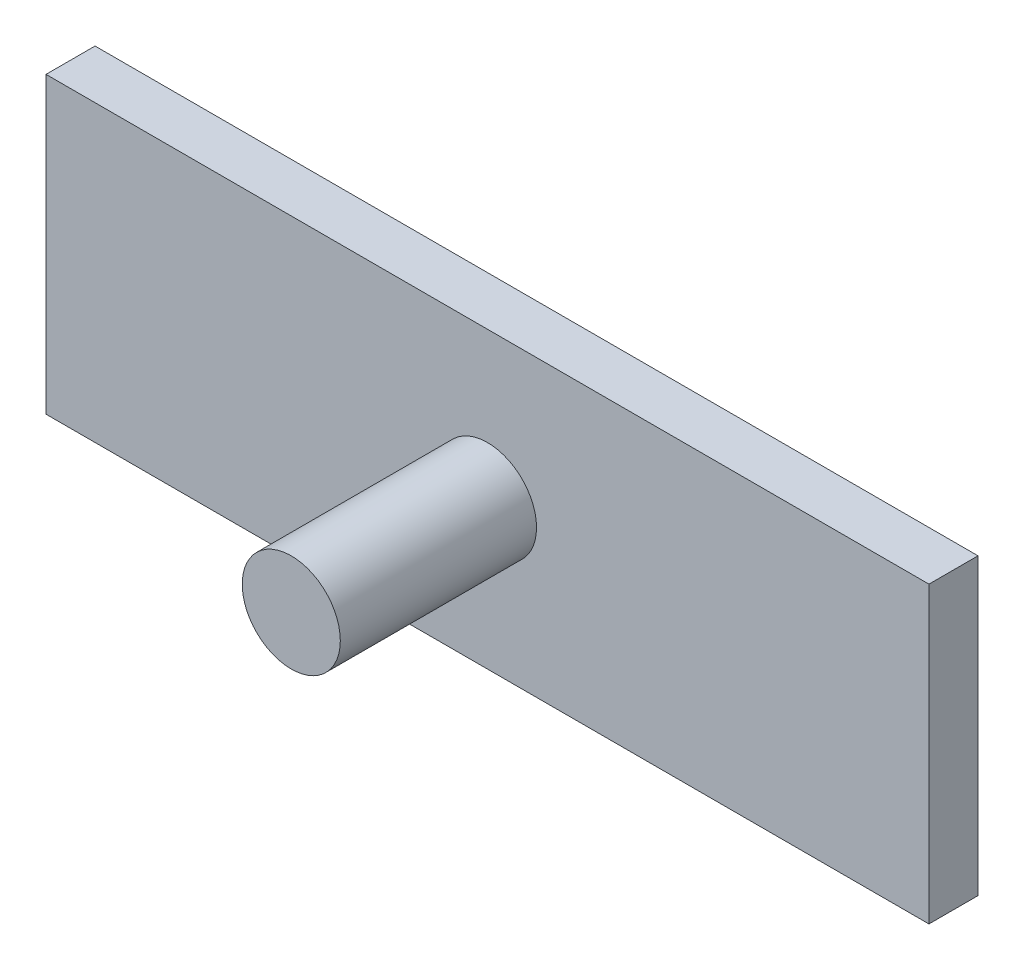
ISO-10303-21;
HEADER;
FILE_DESCRIPTION(('STEP AP214'),'2;1');
FILE_NAME('part.step','',(''),(''),'','','');
FILE_SCHEMA(('AUTOMOTIVE_DESIGN { 1 0 10303 214 1 1 1 1 }'));
ENDSEC;
DATA;
#1=APPLICATION_CONTEXT('core data for automotive mechanical design processes');
#2=APPLICATION_PROTOCOL_DEFINITION('international standard','automotive_design',2000,#1);
#3=PRODUCT_CONTEXT('',#1,'mechanical');
#4=PRODUCT('Part','Part','',(#3));
#5=PRODUCT_RELATED_PRODUCT_CATEGORY('part','',(#4));
#6=PRODUCT_DEFINITION_FORMATION('','',#4);
#7=PRODUCT_DEFINITION_CONTEXT('part definition',#1,'design');
#8=PRODUCT_DEFINITION('design','',#6,#7);
#9=PRODUCT_DEFINITION_SHAPE('','',#8);
#10=(LENGTH_UNIT() NAMED_UNIT(*) SI_UNIT(.MILLI.,.METRE.));
#11=(NAMED_UNIT(*) PLANE_ANGLE_UNIT() SI_UNIT($,.RADIAN.));
#12=(NAMED_UNIT(*) SI_UNIT($,.STERADIAN.) SOLID_ANGLE_UNIT());
#13=UNCERTAINTY_MEASURE_WITH_UNIT(LENGTH_MEASURE(1.E-05),#10,'distance_accuracy_value','');
#14=(GEOMETRIC_REPRESENTATION_CONTEXT(3) GLOBAL_UNCERTAINTY_ASSIGNED_CONTEXT((#13)) GLOBAL_UNIT_ASSIGNED_CONTEXT((#10,
#11,#12)) REPRESENTATION_CONTEXT('',''));
#15=CARTESIAN_POINT('',(0.,0.,0.));
#16=DIRECTION('',(0.,0.,1.));
#17=DIRECTION('',(1.,0.,0.));
#18=AXIS2_PLACEMENT_3D('',#15,#16,#17);
#19=CARTESIAN_POINT('',(0.,0.,5.));
#20=DIRECTION('',(0.,0.,1.));
#21=DIRECTION('',(1.,0.,0.));
#22=AXIS2_PLACEMENT_3D('',#19,#20,#21);
#23=PLANE('',#22);
#24=DIRECTION('',(0.,1.,0.));
#25=VECTOR('',#24,1.);
#26=CARTESIAN_POINT('',(0.,0.,5.));
#27=LINE('',#26,#25);
#28=CARTESIAN_POINT('',(0.,0.,5.));
#29=VERTEX_POINT('',#28);
#30=CARTESIAN_POINT('',(0.,30.,5.));
#31=VERTEX_POINT('',#30);
#32=EDGE_CURVE('E85',#29,#31,#27,.T.);
#33=ORIENTED_EDGE('',*,*,#32,.T.);
#34=DIRECTION('',(-1.,0.,0.));
#35=VECTOR('',#34,1.);
#36=CARTESIAN_POINT('',(0.,30.,5.));
#37=LINE('',#36,#35);
#38=CARTESIAN_POINT('',(-90.,30.,5.));
#39=VERTEX_POINT('',#38);
#40=EDGE_CURVE('E80',#31,#39,#37,.T.);
#41=ORIENTED_EDGE('',*,*,#40,.T.);
#42=DIRECTION('',(0.,-1.,0.));
#43=VECTOR('',#42,1.);
#44=CARTESIAN_POINT('',(-90.,0.,5.));
#45=LINE('',#44,#43);
#46=CARTESIAN_POINT('',(-90.,0.,5.));
#47=VERTEX_POINT('',#46);
#48=EDGE_CURVE('E83',#39,#47,#45,.T.);
#49=ORIENTED_EDGE('',*,*,#48,.T.);
#50=DIRECTION('',(1.,0.,0.));
#51=VECTOR('',#50,1.);
#52=CARTESIAN_POINT('',(0.,0.,5.));
#53=LINE('',#52,#51);
#54=EDGE_CURVE('E50',#47,#29,#53,.T.);
#55=ORIENTED_EDGE('',*,*,#54,.T.);
#56=EDGE_LOOP('',(#33,#41,#49,#55));
#57=FACE_BOUND('',#56,.T.);
#58=CARTESIAN_POINT('',(-45.,15.,5.));
#59=DIRECTION('',(0.,0.,1.));
#60=DIRECTION('',(1.,0.,0.));
#61=AXIS2_PLACEMENT_3D('',#58,#59,#60);
#62=CIRCLE('',#61,5.);
#63=CARTESIAN_POINT('',(-40.,15.,5.));
#64=VERTEX_POINT('',#63);
#65=EDGE_CURVE('E111',#64,#64,#62,.T.);
#66=ORIENTED_EDGE('',*,*,#65,.F.);
#67=EDGE_LOOP('',(#66));
#68=FACE_BOUND('',#67,.T.);
#69=ADVANCED_FACE('F33',(#57,#68),#23,.T.);
#70=CARTESIAN_POINT('',(0.,0.,5.));
#71=DIRECTION('',(-1.,0.,0.));
#72=DIRECTION('',(0.,0.,1.));
#73=AXIS2_PLACEMENT_3D('',#70,#71,#72);
#74=PLANE('',#73);
#75=DIRECTION('',(0.,1.,0.));
#76=VECTOR('',#75,1.);
#77=CARTESIAN_POINT('',(0.,0.,0.));
#78=LINE('',#77,#76);
#79=CARTESIAN_POINT('',(0.,0.,0.));
#80=VERTEX_POINT('',#79);
#81=CARTESIAN_POINT('',(0.,30.,0.));
#82=VERTEX_POINT('',#81);
#83=EDGE_CURVE('E97',#80,#82,#78,.T.);
#84=ORIENTED_EDGE('',*,*,#83,.T.);
#85=DIRECTION('',(0.,0.,-1.));
#86=VECTOR('',#85,1.);
#87=CARTESIAN_POINT('',(0.,30.,5.));
#88=LINE('',#87,#86);
#89=EDGE_CURVE('E11',#31,#82,#88,.T.);
#90=ORIENTED_EDGE('',*,*,#89,.F.);
#91=ORIENTED_EDGE('',*,*,#32,.F.);
#92=DIRECTION('',(0.,0.,-1.));
#93=VECTOR('',#92,1.);
#94=CARTESIAN_POINT('',(0.,0.,5.));
#95=LINE('',#94,#93);
#96=EDGE_CURVE('E93',#29,#80,#95,.T.);
#97=ORIENTED_EDGE('',*,*,#96,.T.);
#98=EDGE_LOOP('',(#84,#90,#91,#97));
#99=FACE_BOUND('',#98,.T.);
#100=ADVANCED_FACE('F35',(#99),#74,.F.);
#101=CARTESIAN_POINT('',(0.,30.,5.));
#102=DIRECTION('',(0.,-1.,0.));
#103=DIRECTION('',(1.,0.,0.));
#104=AXIS2_PLACEMENT_3D('',#101,#102,#103);
#105=PLANE('',#104);
#106=DIRECTION('',(-1.,0.,0.));
#107=VECTOR('',#106,1.);
#108=CARTESIAN_POINT('',(0.,30.,0.));
#109=LINE('',#108,#107);
#110=CARTESIAN_POINT('',(-90.,30.,0.));
#111=VERTEX_POINT('',#110);
#112=EDGE_CURVE('E89',#82,#111,#109,.T.);
#113=ORIENTED_EDGE('',*,*,#112,.T.);
#114=DIRECTION('',(0.,0.,-1.));
#115=VECTOR('',#114,1.);
#116=CARTESIAN_POINT('',(-90.,30.,5.));
#117=LINE('',#116,#115);
#118=EDGE_CURVE('E42',#39,#111,#117,.T.);
#119=ORIENTED_EDGE('',*,*,#118,.F.);
#120=ORIENTED_EDGE('',*,*,#40,.F.);
#121=ORIENTED_EDGE('',*,*,#89,.T.);
#122=EDGE_LOOP('',(#113,#119,#120,#121));
#123=FACE_BOUND('',#122,.T.);
#124=ADVANCED_FACE('F88',(#123),#105,.F.);
#125=CARTESIAN_POINT('',(-90.,0.,5.));
#126=DIRECTION('',(1.,0.,0.));
#127=DIRECTION('',(0.,0.,-1.));
#128=AXIS2_PLACEMENT_3D('',#125,#126,#127);
#129=PLANE('',#128);
#130=DIRECTION('',(0.,-1.,0.));
#131=VECTOR('',#130,1.);
#132=CARTESIAN_POINT('',(-90.,0.,0.));
#133=LINE('',#132,#131);
#134=CARTESIAN_POINT('',(-90.,0.,0.));
#135=VERTEX_POINT('',#134);
#136=EDGE_CURVE('E67',#111,#135,#133,.T.);
#137=ORIENTED_EDGE('',*,*,#136,.T.);
#138=DIRECTION('',(0.,0.,-1.));
#139=VECTOR('',#138,1.);
#140=CARTESIAN_POINT('',(-90.,0.,5.));
#141=LINE('',#140,#139);
#142=EDGE_CURVE('E90',#47,#135,#141,.T.);
#143=ORIENTED_EDGE('',*,*,#142,.F.);
#144=ORIENTED_EDGE('',*,*,#48,.F.);
#145=ORIENTED_EDGE('',*,*,#118,.T.);
#146=EDGE_LOOP('',(#137,#143,#144,#145));
#147=FACE_BOUND('',#146,.T.);
#148=ADVANCED_FACE('F91',(#147),#129,.F.);
#149=CARTESIAN_POINT('',(0.,0.,5.));
#150=DIRECTION('',(0.,1.,0.));
#151=DIRECTION('',(-1.,0.,0.));
#152=AXIS2_PLACEMENT_3D('',#149,#150,#151);
#153=PLANE('',#152);
#154=DIRECTION('',(1.,0.,0.));
#155=VECTOR('',#154,1.);
#156=CARTESIAN_POINT('',(0.,0.,0.));
#157=LINE('',#156,#155);
#158=EDGE_CURVE('E73',#135,#80,#157,.T.);
#159=ORIENTED_EDGE('',*,*,#158,.T.);
#160=ORIENTED_EDGE('',*,*,#96,.F.);
#161=ORIENTED_EDGE('',*,*,#54,.F.);
#162=ORIENTED_EDGE('',*,*,#142,.T.);
#163=EDGE_LOOP('',(#159,#160,#161,#162));
#164=FACE_BOUND('',#163,.T.);
#165=ADVANCED_FACE('F105',(#164),#153,.F.);
#166=CARTESIAN_POINT('',(0.,0.,0.));
#167=DIRECTION('',(0.,0.,1.));
#168=DIRECTION('',(1.,0.,0.));
#169=AXIS2_PLACEMENT_3D('',#166,#167,#168);
#170=PLANE('',#169);
#171=ORIENTED_EDGE('',*,*,#83,.F.);
#172=ORIENTED_EDGE('',*,*,#158,.F.);
#173=ORIENTED_EDGE('',*,*,#136,.F.);
#174=ORIENTED_EDGE('',*,*,#112,.F.);
#175=EDGE_LOOP('',(#171,#172,#173,#174));
#176=FACE_BOUND('',#175,.T.);
#177=ADVANCED_FACE('F108',(#176),#170,.F.);
#178=CARTESIAN_POINT('',(-45.,15.,25.));
#179=DIRECTION('',(0.,0.,-1.));
#180=DIRECTION('',(-1.,0.,0.));
#181=AXIS2_PLACEMENT_3D('',#178,#179,#180);
#182=CYLINDRICAL_SURFACE('',#181,5.);
#183=CARTESIAN_POINT('',(-45.,15.,25.));
#184=DIRECTION('',(0.,0.,1.));
#185=DIRECTION('',(1.,0.,0.));
#186=AXIS2_PLACEMENT_3D('',#183,#184,#185);
#187=CIRCLE('',#186,5.);
#188=CARTESIAN_POINT('',(-40.,15.,25.));
#189=VERTEX_POINT('',#188);
#190=EDGE_CURVE('E100',#189,#189,#187,.T.);
#191=ORIENTED_EDGE('',*,*,#190,.F.);
#192=EDGE_LOOP('',(#191));
#193=FACE_BOUND('',#192,.T.);
#194=ORIENTED_EDGE('',*,*,#65,.T.);
#195=EDGE_LOOP('',(#194));
#196=FACE_BOUND('',#195,.T.);
#197=ADVANCED_FACE('F119',(#193,#196),#182,.T.);
#198=CARTESIAN_POINT('',(-45.,15.,25.));
#199=DIRECTION('',(0.,0.,1.));
#200=DIRECTION('',(1.,0.,0.));
#201=AXIS2_PLACEMENT_3D('',#198,#199,#200);
#202=PLANE('',#201);
#203=ORIENTED_EDGE('',*,*,#190,.T.);
#204=EDGE_LOOP('',(#203));
#205=FACE_BOUND('',#204,.T.);
#206=ADVANCED_FACE('F117',(#205),#202,.T.);
#207=CLOSED_SHELL('',(#69,#100,#124,#148,#165,#177,#197,#206));
#208=MANIFOLD_SOLID_BREP('B2',#207);
#209=ADVANCED_BREP_SHAPE_REPRESENTATION('',(#18,#208),#14);
#210=SHAPE_DEFINITION_REPRESENTATION(#9,#209);
ENDSEC;
END-ISO-10303-21;
